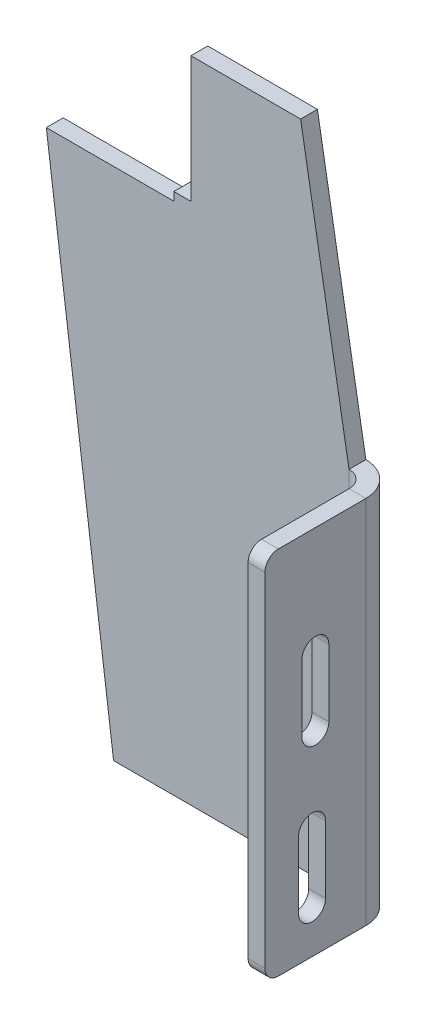
ISO-10303-21;
HEADER;
FILE_DESCRIPTION(('STEP AP214'),'2;1');
FILE_NAME('part.step','',(''),(''),'','','');
FILE_SCHEMA(('AUTOMOTIVE_DESIGN { 1 0 10303 214 1 1 1 1 }'));
ENDSEC;
DATA;
#1=APPLICATION_CONTEXT('core data for automotive mechanical design processes');
#2=APPLICATION_PROTOCOL_DEFINITION('international standard','automotive_design',2000,#1);
#3=PRODUCT_CONTEXT('',#1,'mechanical');
#4=PRODUCT('Part','Part','',(#3));
#5=PRODUCT_RELATED_PRODUCT_CATEGORY('part','',(#4));
#6=PRODUCT_DEFINITION_FORMATION('','',#4);
#7=PRODUCT_DEFINITION_CONTEXT('part definition',#1,'design');
#8=PRODUCT_DEFINITION('design','',#6,#7);
#9=PRODUCT_DEFINITION_SHAPE('','',#8);
#10=(LENGTH_UNIT() NAMED_UNIT(*) SI_UNIT(.MILLI.,.METRE.));
#11=(NAMED_UNIT(*) PLANE_ANGLE_UNIT() SI_UNIT($,.RADIAN.));
#12=(NAMED_UNIT(*) SI_UNIT($,.STERADIAN.) SOLID_ANGLE_UNIT());
#13=UNCERTAINTY_MEASURE_WITH_UNIT(LENGTH_MEASURE(1.E-05),#10,'distance_accuracy_value','');
#14=(GEOMETRIC_REPRESENTATION_CONTEXT(3) GLOBAL_UNCERTAINTY_ASSIGNED_CONTEXT((#13)) GLOBAL_UNIT_ASSIGNED_CONTEXT((#10,
#11,#12)) REPRESENTATION_CONTEXT('',''));
#15=CARTESIAN_POINT('',(0.,0.,0.));
#16=DIRECTION('',(0.,0.,1.));
#17=DIRECTION('',(1.,0.,0.));
#18=AXIS2_PLACEMENT_3D('',#15,#16,#17);
#19=CARTESIAN_POINT('',(-37.6907170617373,-15.3477894324685,-5.));
#20=DIRECTION('',(-1.,0.,0.));
#21=DIRECTION('',(0.,-1.,0.));
#22=AXIS2_PLACEMENT_3D('',#19,#20,#21);
#23=PLANE('',#22);
#24=DIRECTION('',(0.,-1.,0.));
#25=VECTOR('',#24,1.);
#26=CARTESIAN_POINT('',(-37.6907170617373,-15.3477894324685,0.));
#27=LINE('',#26,#25);
#28=CARTESIAN_POINT('',(-37.6907170617373,-12.8477894324692,0.));
#29=VERTEX_POINT('',#28);
#30=CARTESIAN_POINT('',(-37.6907170617373,-15.3477894324685,0.));
#31=VERTEX_POINT('',#30);
#32=EDGE_CURVE('E297',#29,#31,#27,.T.);
#33=ORIENTED_EDGE('',*,*,#32,.F.);
#34=DIRECTION('',(0.,0.,1.));
#35=VECTOR('',#34,1.);
#36=CARTESIAN_POINT('',(-37.6907170617373,-12.8477894324692,-5.));
#37=LINE('',#36,#35);
#38=CARTESIAN_POINT('',(-37.6907170617373,-12.8477894324692,-5.));
#39=VERTEX_POINT('',#38);
#40=EDGE_CURVE('E360',#39,#29,#37,.T.);
#41=ORIENTED_EDGE('',*,*,#40,.F.);
#42=DIRECTION('',(0.,-1.,0.));
#43=VECTOR('',#42,1.);
#44=CARTESIAN_POINT('',(-37.6907170617373,-15.3477894324685,-5.));
#45=LINE('',#44,#43);
#46=CARTESIAN_POINT('',(-37.6907170617373,-15.3477894324685,-5.));
#47=VERTEX_POINT('',#46);
#48=EDGE_CURVE('E306',#39,#47,#45,.T.);
#49=ORIENTED_EDGE('',*,*,#48,.T.);
#50=DIRECTION('',(0.,0.,1.));
#51=VECTOR('',#50,1.);
#52=CARTESIAN_POINT('',(-37.6907170617373,-15.3477894324685,-5.));
#53=LINE('',#52,#51);
#54=EDGE_CURVE('E334',#47,#31,#53,.T.);
#55=ORIENTED_EDGE('',*,*,#54,.T.);
#56=EDGE_LOOP('',(#33,#41,#49,#55));
#57=FACE_BOUND('',#56,.T.);
#58=ADVANCED_FACE('F58',(#57),#23,.T.);
#59=CARTESIAN_POINT('',(-37.6907170617373,-12.8477894324692,-5.));
#60=DIRECTION('',(0.,1.,0.));
#61=DIRECTION('',(-1.,0.,0.));
#62=AXIS2_PLACEMENT_3D('',#59,#60,#61);
#63=PLANE('',#62);
#64=DIRECTION('',(-1.,0.,0.));
#65=VECTOR('',#64,1.);
#66=CARTESIAN_POINT('',(-37.6907170617373,-12.8477894324692,0.));
#67=LINE('',#66,#65);
#68=CARTESIAN_POINT('',(-32.606693765891,-12.8477894324692,0.));
#69=VERTEX_POINT('',#68);
#70=EDGE_CURVE('E310',#69,#29,#67,.T.);
#71=ORIENTED_EDGE('',*,*,#70,.F.);
#72=DIRECTION('',(0.,0.,1.));
#73=VECTOR('',#72,1.);
#74=CARTESIAN_POINT('',(-32.606693765891,-12.8477894324692,-5.));
#75=LINE('',#74,#73);
#76=CARTESIAN_POINT('',(-32.606693765891,-12.8477894324692,-5.));
#77=VERTEX_POINT('',#76);
#78=EDGE_CURVE('E363',#77,#69,#75,.T.);
#79=ORIENTED_EDGE('',*,*,#78,.F.);
#80=DIRECTION('',(-1.,0.,0.));
#81=VECTOR('',#80,1.);
#82=CARTESIAN_POINT('',(-37.6907170617373,-12.8477894324692,-5.));
#83=LINE('',#82,#81);
#84=EDGE_CURVE('E331',#77,#39,#83,.T.);
#85=ORIENTED_EDGE('',*,*,#84,.T.);
#86=ORIENTED_EDGE('',*,*,#40,.T.);
#87=EDGE_LOOP('',(#71,#79,#85,#86));
#88=FACE_BOUND('',#87,.T.);
#89=ADVANCED_FACE('F458',(#88),#63,.T.);
#90=CARTESIAN_POINT('',(-32.606693765891,-12.8477894324692,-5.));
#91=DIRECTION('',(-1.,0.,0.));
#92=DIRECTION('',(0.,0.,1.));
#93=AXIS2_PLACEMENT_3D('',#90,#91,#92);
#94=PLANE('',#93);
#95=DIRECTION('',(0.,-1.,0.));
#96=VECTOR('',#95,1.);
#97=CARTESIAN_POINT('',(-32.606693765891,-12.8477894324692,0.));
#98=LINE('',#97,#96);
#99=CARTESIAN_POINT('',(-32.606693765891,24.6522105675307,0.));
#100=VERTEX_POINT('',#99);
#101=EDGE_CURVE('E355',#100,#69,#98,.T.);
#102=ORIENTED_EDGE('',*,*,#101,.F.);
#103=DIRECTION('',(0.,0.,1.));
#104=VECTOR('',#103,1.);
#105=CARTESIAN_POINT('',(-32.606693765891,24.6522105675307,-5.));
#106=LINE('',#105,#104);
#107=CARTESIAN_POINT('',(-32.606693765891,24.6522105675307,-5.));
#108=VERTEX_POINT('',#107);
#109=EDGE_CURVE('E365',#108,#100,#106,.T.);
#110=ORIENTED_EDGE('',*,*,#109,.F.);
#111=DIRECTION('',(0.,-1.,0.));
#112=VECTOR('',#111,1.);
#113=CARTESIAN_POINT('',(-32.606693765891,-12.8477894324692,-5.));
#114=LINE('',#113,#112);
#115=EDGE_CURVE('E328',#108,#77,#114,.T.);
#116=ORIENTED_EDGE('',*,*,#115,.T.);
#117=ORIENTED_EDGE('',*,*,#78,.T.);
#118=EDGE_LOOP('',(#102,#110,#116,#117));
#119=FACE_BOUND('',#118,.T.);
#120=ADVANCED_FACE('F464',(#119),#94,.T.);
#121=CARTESIAN_POINT('',(-32.606693765891,24.6522105675307,-5.));
#122=DIRECTION('',(0.,1.,0.));
#123=DIRECTION('',(-1.,0.,0.));
#124=AXIS2_PLACEMENT_3D('',#121,#122,#123);
#125=PLANE('',#124);
#126=DIRECTION('',(-1.,0.,0.));
#127=VECTOR('',#126,1.);
#128=CARTESIAN_POINT('',(-32.606693765891,24.6522105675307,0.));
#129=LINE('',#128,#127);
#130=CARTESIAN_POINT('',(0.,24.6522105675307,0.));
#131=VERTEX_POINT('',#130);
#132=EDGE_CURVE('E352',#131,#100,#129,.T.);
#133=ORIENTED_EDGE('',*,*,#132,.F.);
#134=DIRECTION('',(0.,0.,1.));
#135=VECTOR('',#134,1.);
#136=CARTESIAN_POINT('',(0.,24.6522105675307,-5.));
#137=LINE('',#136,#135);
#138=CARTESIAN_POINT('',(0.,24.6522105675307,-5.));
#139=VERTEX_POINT('',#138);
#140=EDGE_CURVE('E367',#139,#131,#137,.T.);
#141=ORIENTED_EDGE('',*,*,#140,.F.);
#142=DIRECTION('',(-1.,0.,0.));
#143=VECTOR('',#142,1.);
#144=CARTESIAN_POINT('',(-32.606693765891,24.6522105675307,-5.));
#145=LINE('',#144,#143);
#146=EDGE_CURVE('E325',#139,#108,#145,.T.);
#147=ORIENTED_EDGE('',*,*,#146,.T.);
#148=ORIENTED_EDGE('',*,*,#109,.T.);
#149=EDGE_LOOP('',(#133,#141,#147,#148));
#150=FACE_BOUND('',#149,.T.);
#151=ADVANCED_FACE('F704',(#150),#125,.T.);
#152=CARTESIAN_POINT('',(14.3933062341091,-58.3477894324685,-5.));
#153=DIRECTION('',(0.985294754055178,0.170863242481657,0.));
#154=DIRECTION('',(-0.170863242481657,0.985294754055178,0.));
#155=AXIS2_PLACEMENT_3D('',#152,#153,#154);
#156=PLANE('',#155);
#157=DIRECTION('',(-0.170863242481657,0.985294754055178,0.));
#158=VECTOR('',#157,1.);
#159=CARTESIAN_POINT('',(14.3933062341091,-58.3477894324685,0.));
#160=LINE('',#159,#158);
#161=CARTESIAN_POINT('',(14.3933062341091,-58.3477894324685,0.));
#162=VERTEX_POINT('',#161);
#163=EDGE_CURVE('E349',#162,#131,#160,.T.);
#164=ORIENTED_EDGE('',*,*,#163,.F.);
#165=DIRECTION('',(0.,0.,1.));
#166=VECTOR('',#165,1.);
#167=CARTESIAN_POINT('',(14.3933062341091,-58.3477894324685,-5.));
#168=LINE('',#167,#166);
#169=CARTESIAN_POINT('',(14.3933062341091,-58.3477894324685,-5.));
#170=VERTEX_POINT('',#169);
#171=EDGE_CURVE('E369',#170,#162,#168,.T.);
#172=ORIENTED_EDGE('',*,*,#171,.F.);
#173=DIRECTION('',(-0.170863242481657,0.985294754055178,0.));
#174=VECTOR('',#173,1.);
#175=CARTESIAN_POINT('',(14.3933062341091,-58.3477894324685,-5.));
#176=LINE('',#175,#174);
#177=EDGE_CURVE('E322',#170,#139,#176,.T.);
#178=ORIENTED_EDGE('',*,*,#177,.T.);
#179=ORIENTED_EDGE('',*,*,#140,.T.);
#180=EDGE_LOOP('',(#164,#172,#178,#179));
#181=FACE_BOUND('',#180,.T.);
#182=ADVANCED_FACE('F695',(#181),#156,.T.);
#183=CARTESIAN_POINT('',(-55.6066937658909,-168.347789432469,-5.));
#184=DIRECTION('',(0.,-1.,0.));
#185=DIRECTION('',(0.,0.,-1.));
#186=AXIS2_PLACEMENT_3D('',#183,#184,#185);
#187=PLANE('',#186);
#188=DIRECTION('',(1.,0.,0.));
#189=VECTOR('',#188,1.);
#190=CARTESIAN_POINT('',(-55.6066937658909,-168.347789432469,0.));
#191=LINE('',#190,#189);
#192=CARTESIAN_POINT('',(-55.6066937658909,-168.347789432469,0.));
#193=VERTEX_POINT('',#192);
#194=CARTESIAN_POINT('',(14.3933062341091,-168.347789432469,0.));
#195=VERTEX_POINT('',#194);
#196=EDGE_CURVE('E343',#193,#195,#191,.T.);
#197=ORIENTED_EDGE('',*,*,#196,.F.);
#198=DIRECTION('',(0.,0.,1.));
#199=VECTOR('',#198,1.);
#200=CARTESIAN_POINT('',(-55.6066937658909,-168.347789432469,-5.));
#201=LINE('',#200,#199);
#202=CARTESIAN_POINT('',(-55.6066937658909,-168.347789432469,-5.));
#203=VERTEX_POINT('',#202);
#204=EDGE_CURVE('E374',#203,#193,#201,.T.);
#205=ORIENTED_EDGE('',*,*,#204,.F.);
#206=DIRECTION('',(1.,0.,0.));
#207=VECTOR('',#206,1.);
#208=CARTESIAN_POINT('',(-55.6066937658909,-168.347789432469,-5.));
#209=LINE('',#208,#207);
#210=CARTESIAN_POINT('',(14.3933062341091,-168.347789432469,-5.));
#211=VERTEX_POINT('',#210);
#212=EDGE_CURVE('E316',#203,#211,#209,.T.);
#213=ORIENTED_EDGE('',*,*,#212,.T.);
#214=DIRECTION('',(0.,0.,1.));
#215=VECTOR('',#214,1.);
#216=CARTESIAN_POINT('',(14.3933062341091,-168.347789432469,-5.));
#217=LINE('',#216,#215);
#218=EDGE_CURVE('E372',#211,#195,#217,.T.);
#219=ORIENTED_EDGE('',*,*,#218,.T.);
#220=EDGE_LOOP('',(#197,#205,#213,#219));
#221=FACE_BOUND('',#220,.T.);
#222=ADVANCED_FACE('F440',(#221),#187,.T.);
#223=CARTESIAN_POINT('',(-55.6066937658909,-168.347789432469,-5.));
#224=DIRECTION('',(-0.991564234122968,-0.129616239754637,0.));
#225=DIRECTION('',(0.129616239754637,-0.991564234122968,0.));
#226=AXIS2_PLACEMENT_3D('',#223,#224,#225);
#227=PLANE('',#226);
#228=DIRECTION('',(0.129616239754637,-0.991564234122968,0.));
#229=VECTOR('',#228,1.);
#230=CARTESIAN_POINT('',(-55.6066937658909,-168.347789432469,0.));
#231=LINE('',#230,#229);
#232=CARTESIAN_POINT('',(-75.6066937658909,-15.3477894324685,0.));
#233=VERTEX_POINT('',#232);
#234=EDGE_CURVE('E340',#233,#193,#231,.T.);
#235=ORIENTED_EDGE('',*,*,#234,.F.);
#236=DIRECTION('',(0.,0.,1.));
#237=VECTOR('',#236,1.);
#238=CARTESIAN_POINT('',(-75.6066937658909,-15.3477894324685,-5.));
#239=LINE('',#238,#237);
#240=CARTESIAN_POINT('',(-75.6066937658909,-15.3477894324685,-5.));
#241=VERTEX_POINT('',#240);
#242=EDGE_CURVE('E376',#241,#233,#239,.T.);
#243=ORIENTED_EDGE('',*,*,#242,.F.);
#244=DIRECTION('',(0.129616239754637,-0.991564234122968,0.));
#245=VECTOR('',#244,1.);
#246=CARTESIAN_POINT('',(-55.6066937658909,-168.347789432469,-5.));
#247=LINE('',#246,#245);
#248=EDGE_CURVE('E313',#241,#203,#247,.T.);
#249=ORIENTED_EDGE('',*,*,#248,.T.);
#250=ORIENTED_EDGE('',*,*,#204,.T.);
#251=EDGE_LOOP('',(#235,#243,#249,#250));
#252=FACE_BOUND('',#251,.T.);
#253=ADVANCED_FACE('F675',(#252),#227,.T.);
#254=CARTESIAN_POINT('',(-75.6066937658909,-15.3477894324685,-5.));
#255=DIRECTION('',(0.,1.,0.));
#256=DIRECTION('',(-1.,0.,0.));
#257=AXIS2_PLACEMENT_3D('',#254,#255,#256);
#258=PLANE('',#257);
#259=DIRECTION('',(-1.,0.,0.));
#260=VECTOR('',#259,1.);
#261=CARTESIAN_POINT('',(-75.6066937658909,-15.3477894324685,0.));
#262=LINE('',#261,#260);
#263=EDGE_CURVE('E337',#31,#233,#262,.T.);
#264=ORIENTED_EDGE('',*,*,#263,.F.);
#265=ORIENTED_EDGE('',*,*,#54,.F.);
#266=DIRECTION('',(-1.,0.,0.));
#267=VECTOR('',#266,1.);
#268=CARTESIAN_POINT('',(-75.6066937658909,-15.3477894324685,-5.));
#269=LINE('',#268,#267);
#270=EDGE_CURVE('E309',#47,#241,#269,.T.);
#271=ORIENTED_EDGE('',*,*,#270,.T.);
#272=ORIENTED_EDGE('',*,*,#242,.T.);
#273=EDGE_LOOP('',(#264,#265,#271,#272));
#274=FACE_BOUND('',#273,.T.);
#275=ADVANCED_FACE('F469',(#274),#258,.T.);
#276=CARTESIAN_POINT('',(0.,0.,-5.));
#277=DIRECTION('',(0.,0.,-1.));
#278=DIRECTION('',(-1.,0.,0.));
#279=AXIS2_PLACEMENT_3D('',#276,#277,#278);
#280=PLANE('',#279);
#281=ORIENTED_EDGE('',*,*,#48,.F.);
#282=ORIENTED_EDGE('',*,*,#84,.F.);
#283=ORIENTED_EDGE('',*,*,#115,.F.);
#284=ORIENTED_EDGE('',*,*,#146,.F.);
#285=ORIENTED_EDGE('',*,*,#177,.F.);
#286=DIRECTION('',(0.,1.,0.));
#287=VECTOR('',#286,1.);
#288=CARTESIAN_POINT('',(14.3933062341091,-168.347789432469,-5.));
#289=LINE('',#288,#287);
#290=EDGE_CURVE('E319',#211,#170,#289,.T.);
#291=ORIENTED_EDGE('',*,*,#290,.F.);
#292=ORIENTED_EDGE('',*,*,#212,.F.);
#293=ORIENTED_EDGE('',*,*,#248,.F.);
#294=ORIENTED_EDGE('',*,*,#270,.F.);
#295=EDGE_LOOP('',(#281,#282,#283,#284,#285,#291,#292,#293,#294));
#296=FACE_BOUND('',#295,.T.);
#297=ADVANCED_FACE('F654',(#296),#280,.T.);
#298=CARTESIAN_POINT('',(0.,0.,0.));
#299=DIRECTION('',(0.,0.,-1.));
#300=DIRECTION('',(-1.,0.,0.));
#301=AXIS2_PLACEMENT_3D('',#298,#299,#300);
#302=PLANE('',#301);
#303=ORIENTED_EDGE('',*,*,#32,.T.);
#304=ORIENTED_EDGE('',*,*,#263,.T.);
#305=ORIENTED_EDGE('',*,*,#234,.T.);
#306=ORIENTED_EDGE('',*,*,#196,.T.);
#307=DIRECTION('',(0.,1.,0.));
#308=VECTOR('',#307,1.);
#309=CARTESIAN_POINT('',(14.3933062341091,-168.347789432469,0.));
#310=LINE('',#309,#308);
#311=EDGE_CURVE('E346',#195,#162,#310,.T.);
#312=ORIENTED_EDGE('',*,*,#311,.T.);
#313=ORIENTED_EDGE('',*,*,#163,.T.);
#314=ORIENTED_EDGE('',*,*,#132,.T.);
#315=ORIENTED_EDGE('',*,*,#101,.T.);
#316=ORIENTED_EDGE('',*,*,#70,.T.);
#317=EDGE_LOOP('',(#303,#304,#305,#306,#312,#313,#314,#315,#316));
#318=FACE_BOUND('',#317,.T.);
#319=ADVANCED_FACE('F444',(#318),#302,.F.);
#320=CARTESIAN_POINT('',(14.3933062341091,-168.347789432469,5.));
#321=DIRECTION('',(0.,-1.,0.));
#322=DIRECTION('',(0.,0.,-1.));
#323=AXIS2_PLACEMENT_3D('',#320,#321,#322);
#324=PLANE('',#323);
#325=DIRECTION('',(-1.,0.,0.));
#326=VECTOR('',#325,1.);
#327=CARTESIAN_POINT('',(24.3933062341091,-168.347789432469,4.99999999999997));
#328=LINE('',#327,#326);
#329=CARTESIAN_POINT('',(19.3933062341091,-168.347789432469,4.99999999999999));
#330=VERTEX_POINT('',#329);
#331=CARTESIAN_POINT('',(24.3933062341091,-168.347789432469,4.99999999999997));
#332=VERTEX_POINT('',#331);
#333=EDGE_CURVE('E248',#330,#332,#328,.F.);
#334=ORIENTED_EDGE('',*,*,#333,.F.);
#335=CARTESIAN_POINT('',(14.3933062341091,-168.347789432469,5.));
#336=DIRECTION('',(0.,1.,0.));
#337=DIRECTION('',(0.,0.,1.));
#338=AXIS2_PLACEMENT_3D('',#335,#336,#337);
#339=CIRCLE('',#338,5.);
#340=EDGE_CURVE('E301',#195,#330,#339,.F.);
#341=ORIENTED_EDGE('',*,*,#340,.F.);
#342=ORIENTED_EDGE('',*,*,#218,.F.);
#343=CARTESIAN_POINT('',(14.3933062341091,-168.347789432469,5.));
#344=DIRECTION('',(0.,1.,0.));
#345=DIRECTION('',(0.,0.,1.));
#346=AXIS2_PLACEMENT_3D('',#343,#344,#345);
#347=CIRCLE('',#346,10.);
#348=EDGE_CURVE('E294',#211,#332,#347,.F.);
#349=ORIENTED_EDGE('',*,*,#348,.T.);
#350=EDGE_LOOP('',(#334,#341,#342,#349));
#351=FACE_BOUND('',#350,.T.);
#352=ADVANCED_FACE('F436',(#351),#324,.T.);
#353=CARTESIAN_POINT('',(14.3933062341091,-58.3477894324685,5.));
#354=DIRECTION('',(0.,-1.,0.));
#355=DIRECTION('',(0.,0.,-1.));
#356=AXIS2_PLACEMENT_3D('',#353,#354,#355);
#357=PLANE('',#356);
#358=CARTESIAN_POINT('',(14.3933062341091,-58.3477894324685,5.));
#359=DIRECTION('',(0.,1.,0.));
#360=DIRECTION('',(0.,0.,1.));
#361=AXIS2_PLACEMENT_3D('',#358,#359,#360);
#362=CIRCLE('',#361,5.);
#363=CARTESIAN_POINT('',(19.3933062341091,-58.3477894324685,4.99999999999999));
#364=VERTEX_POINT('',#363);
#365=EDGE_CURVE('E273',#364,#162,#362,.T.);
#366=ORIENTED_EDGE('',*,*,#365,.F.);
#367=DIRECTION('',(-1.,0.,0.));
#368=VECTOR('',#367,1.);
#369=CARTESIAN_POINT('',(19.3933062341091,-58.3477894324685,4.99999999999999));
#370=LINE('',#369,#368);
#371=CARTESIAN_POINT('',(24.3933062341091,-58.3477894324685,4.99999999999997));
#372=VERTEX_POINT('',#371);
#373=EDGE_CURVE('E287',#364,#372,#370,.F.);
#374=ORIENTED_EDGE('',*,*,#373,.T.);
#375=CARTESIAN_POINT('',(14.3933062341091,-58.3477894324685,5.));
#376=DIRECTION('',(0.,1.,0.));
#377=DIRECTION('',(0.,0.,1.));
#378=AXIS2_PLACEMENT_3D('',#375,#376,#377);
#379=CIRCLE('',#378,10.);
#380=EDGE_CURVE('E298',#372,#170,#379,.T.);
#381=ORIENTED_EDGE('',*,*,#380,.T.);
#382=ORIENTED_EDGE('',*,*,#171,.T.);
#383=EDGE_LOOP('',(#366,#374,#381,#382));
#384=FACE_BOUND('',#383,.T.);
#385=ADVANCED_FACE('F430',(#384),#357,.F.);
#386=CARTESIAN_POINT('',(14.3933062341091,-58.3477894324685,5.));
#387=DIRECTION('',(0.,1.,0.));
#388=DIRECTION('',(1.,0.,0.));
#389=AXIS2_PLACEMENT_3D('',#386,#387,#388);
#390=CYLINDRICAL_SURFACE('',#389,10.);
#391=ORIENTED_EDGE('',*,*,#290,.T.);
#392=ORIENTED_EDGE('',*,*,#380,.F.);
#393=DIRECTION('',(0.,1.,0.));
#394=VECTOR('',#393,1.);
#395=CARTESIAN_POINT('',(24.3933062341091,-168.347789432469,4.99999999999997));
#396=LINE('',#395,#394);
#397=EDGE_CURVE('E284',#372,#332,#396,.F.);
#398=ORIENTED_EDGE('',*,*,#397,.T.);
#399=ORIENTED_EDGE('',*,*,#348,.F.);
#400=EDGE_LOOP('',(#391,#392,#398,#399));
#401=FACE_BOUND('',#400,.T.);
#402=ADVANCED_FACE('F433',(#401),#390,.T.);
#403=CARTESIAN_POINT('',(14.3933062341091,-58.3477894324685,5.));
#404=DIRECTION('',(0.,1.,0.));
#405=DIRECTION('',(1.,0.,0.));
#406=AXIS2_PLACEMENT_3D('',#403,#404,#405);
#407=CYLINDRICAL_SURFACE('',#406,5.);
#408=ORIENTED_EDGE('',*,*,#311,.F.);
#409=ORIENTED_EDGE('',*,*,#340,.T.);
#410=DIRECTION('',(0.,1.,0.));
#411=VECTOR('',#410,1.);
#412=CARTESIAN_POINT('',(19.3933062341091,-168.347789432469,4.99999999999998));
#413=LINE('',#412,#411);
#414=EDGE_CURVE('E290',#330,#364,#413,.T.);
#415=ORIENTED_EDGE('',*,*,#414,.T.);
#416=ORIENTED_EDGE('',*,*,#365,.T.);
#417=EDGE_LOOP('',(#408,#409,#415,#416));
#418=FACE_BOUND('',#417,.T.);
#419=ADVANCED_FACE('F447',(#418),#407,.F.);
#420=CARTESIAN_POINT('',(24.3933062341091,-168.347789432469,0.));
#421=DIRECTION('',(0.,1.,0.));
#422=DIRECTION('',(0.,0.,1.));
#423=AXIS2_PLACEMENT_3D('',#420,#421,#422);
#424=PLANE('',#423);
#425=DIRECTION('',(0.,0.,-1.));
#426=VECTOR('',#425,1.);
#427=CARTESIAN_POINT('',(24.3933062341091,-168.347789432469,0.));
#428=LINE('',#427,#426);
#429=CARTESIAN_POINT('',(24.3933062341092,-168.347789432469,31.));
#430=VERTEX_POINT('',#429);
#431=EDGE_CURVE('E276',#430,#332,#428,.T.);
#432=ORIENTED_EDGE('',*,*,#431,.F.);
#433=DIRECTION('',(-1.,0.,0.));
#434=VECTOR('',#433,1.);
#435=CARTESIAN_POINT('',(24.3933062341092,-168.347789432469,31.));
#436=LINE('',#435,#434);
#437=CARTESIAN_POINT('',(19.3933062341092,-168.347789432469,31.));
#438=VERTEX_POINT('',#437);
#439=EDGE_CURVE('E394',#430,#438,#436,.T.);
#440=ORIENTED_EDGE('',*,*,#439,.T.);
#441=DIRECTION('',(0.,0.,1.));
#442=VECTOR('',#441,1.);
#443=CARTESIAN_POINT('',(19.3933062341091,-168.347789432469,0.));
#444=LINE('',#443,#442);
#445=EDGE_CURVE('E282',#438,#330,#444,.F.);
#446=ORIENTED_EDGE('',*,*,#445,.T.);
#447=ORIENTED_EDGE('',*,*,#333,.T.);
#448=EDGE_LOOP('',(#432,#440,#446,#447));
#449=FACE_BOUND('',#448,.T.);
#450=ADVANCED_FACE('F413',(#449),#424,.F.);
#451=CARTESIAN_POINT('',(24.3933062341092,-58.3477894324685,35.));
#452=DIRECTION('',(0.,-1.,0.));
#453=DIRECTION('',(0.,0.,-1.));
#454=AXIS2_PLACEMENT_3D('',#451,#452,#453);
#455=PLANE('',#454);
#456=DIRECTION('',(0.,0.,-1.));
#457=VECTOR('',#456,1.);
#458=CARTESIAN_POINT('',(19.3933062341092,-58.3477894324685,35.));
#459=LINE('',#458,#457);
#460=CARTESIAN_POINT('',(19.3933062341092,-58.3477894324685,31.));
#461=VERTEX_POINT('',#460);
#462=EDGE_CURVE('E280',#364,#461,#459,.F.);
#463=ORIENTED_EDGE('',*,*,#462,.T.);
#464=DIRECTION('',(-1.,0.,0.));
#465=VECTOR('',#464,1.);
#466=CARTESIAN_POINT('',(24.3933062341092,-58.3477894324685,31.));
#467=LINE('',#466,#465);
#468=CARTESIAN_POINT('',(24.3933062341092,-58.3477894324685,31.));
#469=VERTEX_POINT('',#468);
#470=EDGE_CURVE('E13',#461,#469,#467,.F.);
#471=ORIENTED_EDGE('',*,*,#470,.T.);
#472=DIRECTION('',(0.,0.,1.));
#473=VECTOR('',#472,1.);
#474=CARTESIAN_POINT('',(24.3933062341091,-58.3477894324685,0.));
#475=LINE('',#474,#473);
#476=EDGE_CURVE('E274',#372,#469,#475,.T.);
#477=ORIENTED_EDGE('',*,*,#476,.F.);
#478=ORIENTED_EDGE('',*,*,#373,.F.);
#479=EDGE_LOOP('',(#463,#471,#477,#478));
#480=FACE_BOUND('',#479,.T.);
#481=ADVANCED_FACE('F427',(#480),#455,.F.);
#482=CARTESIAN_POINT('',(24.3933062341091,0.,0.));
#483=DIRECTION('',(-1.,0.,0.));
#484=DIRECTION('',(0.,0.,1.));
#485=AXIS2_PLACEMENT_3D('',#482,#483,#484);
#486=PLANE('',#485);
#487=DIRECTION('',(0.,1.,0.));
#488=VECTOR('',#487,1.);
#489=CARTESIAN_POINT('',(24.3933062341091,-110.347789432469,16.0000000000001));
#490=LINE('',#489,#488);
#491=CARTESIAN_POINT('',(24.3933062341091,-110.347789432469,16.0000000000001));
#492=VERTEX_POINT('',#491);
#493=CARTESIAN_POINT('',(24.3933062341091,-90.3477894324685,16.0000000000001));
#494=VERTEX_POINT('',#493);
#495=EDGE_CURVE('E231',#492,#494,#490,.T.);
#496=ORIENTED_EDGE('',*,*,#495,.F.);
#497=CARTESIAN_POINT('',(24.3933062341092,-110.347789432469,20.0000000000001));
#498=DIRECTION('',(1.,0.,0.));
#499=DIRECTION('',(0.,0.,-1.));
#500=AXIS2_PLACEMENT_3D('',#497,#498,#499);
#501=CIRCLE('',#500,4.);
#502=CARTESIAN_POINT('',(24.3933062341092,-110.347789432469,24.0000000000001));
#503=VERTEX_POINT('',#502);
#504=EDGE_CURVE('E236',#503,#492,#501,.T.);
#505=ORIENTED_EDGE('',*,*,#504,.F.);
#506=DIRECTION('',(0.,-1.,0.));
#507=VECTOR('',#506,1.);
#508=CARTESIAN_POINT('',(24.3933062341092,-110.347789432469,24.0000000000001));
#509=LINE('',#508,#507);
#510=CARTESIAN_POINT('',(24.3933062341092,-90.3477894324686,24.0000000000001));
#511=VERTEX_POINT('',#510);
#512=EDGE_CURVE('E241',#511,#503,#509,.T.);
#513=ORIENTED_EDGE('',*,*,#512,.F.);
#514=CARTESIAN_POINT('',(24.3933062341092,-90.3477894324685,20.0000000000001));
#515=DIRECTION('',(1.,0.,0.));
#516=DIRECTION('',(0.,0.,-1.));
#517=AXIS2_PLACEMENT_3D('',#514,#515,#516);
#518=CIRCLE('',#517,4.);
#519=EDGE_CURVE('E220',#494,#511,#518,.T.);
#520=ORIENTED_EDGE('',*,*,#519,.F.);
#521=EDGE_LOOP('',(#496,#505,#513,#520));
#522=FACE_BOUND('',#521,.T.);
#523=DIRECTION('',(0.,1.,0.));
#524=VECTOR('',#523,1.);
#525=CARTESIAN_POINT('',(24.3933062341091,-155.336682434891,16.9997531778317));
#526=LINE('',#525,#524);
#527=CARTESIAN_POINT('',(24.3933062341091,-155.336682434891,16.9997531778317));
#528=VERTEX_POINT('',#527);
#529=CARTESIAN_POINT('',(24.3933062341091,-135.336682434891,16.9997531778317));
#530=VERTEX_POINT('',#529);
#531=EDGE_CURVE('E253',#528,#530,#526,.T.);
#532=ORIENTED_EDGE('',*,*,#531,.F.);
#533=CARTESIAN_POINT('',(24.3933062341092,-155.336682434891,20.9997531778317));
#534=DIRECTION('',(1.,0.,0.));
#535=DIRECTION('',(0.,0.,-1.));
#536=AXIS2_PLACEMENT_3D('',#533,#534,#535);
#537=CIRCLE('',#536,4.00000000000001);
#538=CARTESIAN_POINT('',(24.3933062341092,-155.336682434891,24.9997531778317));
#539=VERTEX_POINT('',#538);
#540=EDGE_CURVE('E251',#539,#528,#537,.T.);
#541=ORIENTED_EDGE('',*,*,#540,.F.);
#542=DIRECTION('',(0.,-1.,0.));
#543=VECTOR('',#542,1.);
#544=CARTESIAN_POINT('',(24.3933062341092,-155.336682434891,24.9997531778317));
#545=LINE('',#544,#543);
#546=CARTESIAN_POINT('',(24.3933062341092,-135.336682434891,24.9997531778317));
#547=VERTEX_POINT('',#546);
#548=EDGE_CURVE('E259',#547,#539,#545,.T.);
#549=ORIENTED_EDGE('',*,*,#548,.F.);
#550=CARTESIAN_POINT('',(24.3933062341092,-135.336682434891,20.9997531778317));
#551=DIRECTION('',(1.,0.,0.));
#552=DIRECTION('',(0.,0.,-1.));
#553=AXIS2_PLACEMENT_3D('',#550,#551,#552);
#554=CIRCLE('',#553,4.00000000000001);
#555=EDGE_CURVE('E256',#530,#547,#554,.T.);
#556=ORIENTED_EDGE('',*,*,#555,.F.);
#557=EDGE_LOOP('',(#532,#541,#549,#556));
#558=FACE_BOUND('',#557,.T.);
#559=DIRECTION('',(0.,-1.,0.));
#560=VECTOR('',#559,1.);
#561=CARTESIAN_POINT('',(24.3933062341092,0.,35.));
#562=LINE('',#561,#560);
#563=CARTESIAN_POINT('',(24.3933062341092,-62.3477894324685,35.));
#564=VERTEX_POINT('',#563);
#565=CARTESIAN_POINT('',(24.3933062341092,-164.347789432469,35.));
#566=VERTEX_POINT('',#565);
#567=EDGE_CURVE('E271',#564,#566,#562,.T.);
#568=ORIENTED_EDGE('',*,*,#567,.T.);
#569=CARTESIAN_POINT('',(24.3933062341092,-164.347789432469,31.));
#570=DIRECTION('',(-1.,0.,0.));
#571=DIRECTION('',(0.,0.,1.));
#572=AXIS2_PLACEMENT_3D('',#569,#570,#571);
#573=CIRCLE('',#572,4.);
#574=EDGE_CURVE('E66',#566,#430,#573,.F.);
#575=ORIENTED_EDGE('',*,*,#574,.T.);
#576=ORIENTED_EDGE('',*,*,#431,.T.);
#577=ORIENTED_EDGE('',*,*,#397,.F.);
#578=ORIENTED_EDGE('',*,*,#476,.T.);
#579=CARTESIAN_POINT('',(24.3933062341092,-62.3477894324685,31.));
#580=DIRECTION('',(-1.,0.,0.));
#581=DIRECTION('',(0.,0.,1.));
#582=AXIS2_PLACEMENT_3D('',#579,#580,#581);
#583=CIRCLE('',#582,4.);
#584=EDGE_CURVE('E405',#469,#564,#583,.F.);
#585=ORIENTED_EDGE('',*,*,#584,.T.);
#586=EDGE_LOOP('',(#568,#575,#576,#577,#578,#585));
#587=FACE_BOUND('',#586,.T.);
#588=ADVANCED_FACE('F238',(#522,#558,#587),#486,.F.);
#589=CARTESIAN_POINT('',(19.3933062341091,0.,0.));
#590=DIRECTION('',(-1.,0.,0.));
#591=DIRECTION('',(0.,0.,1.));
#592=AXIS2_PLACEMENT_3D('',#589,#590,#591);
#593=PLANE('',#592);
#594=CARTESIAN_POINT('',(19.3933062341092,-110.347789432469,20.0000000000001));
#595=DIRECTION('',(-1.,0.,0.));
#596=DIRECTION('',(0.,0.,1.));
#597=AXIS2_PLACEMENT_3D('',#594,#595,#596);
#598=CIRCLE('',#597,4.);
#599=CARTESIAN_POINT('',(19.3933062341091,-110.347789432469,16.0000000000001));
#600=VERTEX_POINT('',#599);
#601=CARTESIAN_POINT('',(19.3933062341092,-110.347789432469,24.0000000000001));
#602=VERTEX_POINT('',#601);
#603=EDGE_CURVE('E392',#600,#602,#598,.T.);
#604=ORIENTED_EDGE('',*,*,#603,.F.);
#605=DIRECTION('',(0.,-1.,0.));
#606=VECTOR('',#605,1.);
#607=CARTESIAN_POINT('',(19.3933062341091,0.,16.0000000000001));
#608=LINE('',#607,#606);
#609=CARTESIAN_POINT('',(19.3933062341091,-90.3477894324685,16.0000000000001));
#610=VERTEX_POINT('',#609);
#611=EDGE_CURVE('E387',#610,#600,#608,.T.);
#612=ORIENTED_EDGE('',*,*,#611,.F.);
#613=CARTESIAN_POINT('',(19.3933062341092,-90.3477894324685,20.0000000000001));
#614=DIRECTION('',(-1.,0.,0.));
#615=DIRECTION('',(0.,0.,1.));
#616=AXIS2_PLACEMENT_3D('',#613,#614,#615);
#617=CIRCLE('',#616,4.);
#618=CARTESIAN_POINT('',(19.3933062341092,-90.3477894324686,24.0000000000001));
#619=VERTEX_POINT('',#618);
#620=EDGE_CURVE('E223',#619,#610,#617,.T.);
#621=ORIENTED_EDGE('',*,*,#620,.F.);
#622=DIRECTION('',(0.,1.,0.));
#623=VECTOR('',#622,1.);
#624=CARTESIAN_POINT('',(19.3933062341092,0.,24.0000000000001));
#625=LINE('',#624,#623);
#626=EDGE_CURVE('E390',#602,#619,#625,.T.);
#627=ORIENTED_EDGE('',*,*,#626,.F.);
#628=EDGE_LOOP('',(#604,#612,#621,#627));
#629=FACE_BOUND('',#628,.T.);
#630=CARTESIAN_POINT('',(19.3933062341092,-155.336682434891,20.9997531778317));
#631=DIRECTION('',(-1.,0.,0.));
#632=DIRECTION('',(0.,0.,1.));
#633=AXIS2_PLACEMENT_3D('',#630,#631,#632);
#634=CIRCLE('',#633,4.00000000000001);
#635=CARTESIAN_POINT('',(19.3933062341091,-155.336682434891,16.9997531778317));
#636=VERTEX_POINT('',#635);
#637=CARTESIAN_POINT('',(19.3933062341092,-155.336682434891,24.9997531778317));
#638=VERTEX_POINT('',#637);
#639=EDGE_CURVE('E385',#636,#638,#634,.T.);
#640=ORIENTED_EDGE('',*,*,#639,.F.);
#641=DIRECTION('',(0.,-1.,0.));
#642=VECTOR('',#641,1.);
#643=CARTESIAN_POINT('',(19.3933062341091,0.,16.9997531778317));
#644=LINE('',#643,#642);
#645=CARTESIAN_POINT('',(19.3933062341091,-135.336682434891,16.9997531778317));
#646=VERTEX_POINT('',#645);
#647=EDGE_CURVE('E362',#646,#636,#644,.T.);
#648=ORIENTED_EDGE('',*,*,#647,.F.);
#649=CARTESIAN_POINT('',(19.3933062341092,-135.336682434891,20.9997531778317));
#650=DIRECTION('',(-1.,0.,0.));
#651=DIRECTION('',(0.,0.,1.));
#652=AXIS2_PLACEMENT_3D('',#649,#650,#651);
#653=CIRCLE('',#652,4.00000000000001);
#654=CARTESIAN_POINT('',(19.3933062341092,-135.336682434891,24.9997531778317));
#655=VERTEX_POINT('',#654);
#656=EDGE_CURVE('E380',#655,#646,#653,.T.);
#657=ORIENTED_EDGE('',*,*,#656,.F.);
#658=DIRECTION('',(0.,1.,0.));
#659=VECTOR('',#658,1.);
#660=CARTESIAN_POINT('',(19.3933062341092,0.,24.9997531778318));
#661=LINE('',#660,#659);
#662=EDGE_CURVE('E383',#638,#655,#661,.T.);
#663=ORIENTED_EDGE('',*,*,#662,.F.);
#664=EDGE_LOOP('',(#640,#648,#657,#663));
#665=FACE_BOUND('',#664,.T.);
#666=ORIENTED_EDGE('',*,*,#445,.F.);
#667=CARTESIAN_POINT('',(19.3933062341092,-164.347789432469,31.));
#668=DIRECTION('',(-1.,0.,0.));
#669=DIRECTION('',(0.,0.,1.));
#670=AXIS2_PLACEMENT_3D('',#667,#668,#669);
#671=CIRCLE('',#670,4.);
#672=CARTESIAN_POINT('',(19.3933062341092,-164.347789432469,35.));
#673=VERTEX_POINT('',#672);
#674=EDGE_CURVE('E399',#438,#673,#671,.T.);
#675=ORIENTED_EDGE('',*,*,#674,.T.);
#676=DIRECTION('',(0.,1.,0.));
#677=VECTOR('',#676,1.);
#678=CARTESIAN_POINT('',(19.3933062341092,-168.347789432469,35.));
#679=LINE('',#678,#677);
#680=CARTESIAN_POINT('',(19.3933062341092,-62.3477894324685,35.));
#681=VERTEX_POINT('',#680);
#682=EDGE_CURVE('E278',#681,#673,#679,.F.);
#683=ORIENTED_EDGE('',*,*,#682,.F.);
#684=CARTESIAN_POINT('',(19.3933062341092,-62.3477894324685,31.));
#685=DIRECTION('',(-1.,0.,0.));
#686=DIRECTION('',(0.,0.,1.));
#687=AXIS2_PLACEMENT_3D('',#684,#685,#686);
#688=CIRCLE('',#687,4.);
#689=EDGE_CURVE('E397',#681,#461,#688,.T.);
#690=ORIENTED_EDGE('',*,*,#689,.T.);
#691=ORIENTED_EDGE('',*,*,#462,.F.);
#692=ORIENTED_EDGE('',*,*,#414,.F.);
#693=EDGE_LOOP('',(#666,#675,#683,#690,#691,#692));
#694=FACE_BOUND('',#693,.T.);
#695=ADVANCED_FACE('F419',(#629,#665,#694),#593,.T.);
#696=CARTESIAN_POINT('',(24.3933062341092,-168.347789432469,35.));
#697=DIRECTION('',(0.,0.,-1.));
#698=DIRECTION('',(-1.,0.,0.));
#699=AXIS2_PLACEMENT_3D('',#696,#697,#698);
#700=PLANE('',#699);
#701=ORIENTED_EDGE('',*,*,#682,.T.);
#702=DIRECTION('',(-1.,0.,0.));
#703=VECTOR('',#702,1.);
#704=CARTESIAN_POINT('',(24.3933062341092,-164.347789432469,35.));
#705=LINE('',#704,#703);
#706=EDGE_CURVE('E79',#673,#566,#705,.F.);
#707=ORIENTED_EDGE('',*,*,#706,.T.);
#708=ORIENTED_EDGE('',*,*,#567,.F.);
#709=DIRECTION('',(-1.,0.,0.));
#710=VECTOR('',#709,1.);
#711=CARTESIAN_POINT('',(24.3933062341092,-62.3477894324685,35.));
#712=LINE('',#711,#710);
#713=EDGE_CURVE('E401',#564,#681,#712,.T.);
#714=ORIENTED_EDGE('',*,*,#713,.T.);
#715=EDGE_LOOP('',(#701,#707,#708,#714));
#716=FACE_BOUND('',#715,.T.);
#717=ADVANCED_FACE('F421',(#716),#700,.F.);
#718=CARTESIAN_POINT('',(-75.606693765891,-155.336682434891,20.999753177832));
#719=DIRECTION('',(1.,0.,0.));
#720=DIRECTION('',(0.,0.,-1.));
#721=AXIS2_PLACEMENT_3D('',#718,#719,#720);
#722=CYLINDRICAL_SURFACE('',#721,4.00000000000001);
#723=ORIENTED_EDGE('',*,*,#639,.T.);
#724=DIRECTION('',(1.,0.,0.));
#725=VECTOR('',#724,1.);
#726=CARTESIAN_POINT('',(-75.606693765891,-155.336682434891,24.999753177832));
#727=LINE('',#726,#725);
#728=EDGE_CURVE('E263',#638,#539,#727,.T.);
#729=ORIENTED_EDGE('',*,*,#728,.T.);
#730=ORIENTED_EDGE('',*,*,#540,.T.);
#731=DIRECTION('',(1.,0.,0.));
#732=VECTOR('',#731,1.);
#733=CARTESIAN_POINT('',(-75.606693765891,-155.336682434891,16.999753177832));
#734=LINE('',#733,#732);
#735=EDGE_CURVE('E262',#636,#528,#734,.T.);
#736=ORIENTED_EDGE('',*,*,#735,.F.);
#737=EDGE_LOOP('',(#723,#729,#730,#736));
#738=FACE_BOUND('',#737,.T.);
#739=ADVANCED_FACE('F493',(#738),#722,.F.);
#740=CARTESIAN_POINT('',(-75.606693765891,-155.336682434891,24.999753177832));
#741=DIRECTION('',(0.,0.,1.));
#742=DIRECTION('',(1.,0.,0.));
#743=AXIS2_PLACEMENT_3D('',#740,#741,#742);
#744=PLANE('',#743);
#745=ORIENTED_EDGE('',*,*,#662,.T.);
#746=DIRECTION('',(1.,0.,0.));
#747=VECTOR('',#746,1.);
#748=CARTESIAN_POINT('',(-75.606693765891,-135.336682434891,24.9997531778321));
#749=LINE('',#748,#747);
#750=EDGE_CURVE('E265',#655,#547,#749,.T.);
#751=ORIENTED_EDGE('',*,*,#750,.T.);
#752=ORIENTED_EDGE('',*,*,#548,.T.);
#753=ORIENTED_EDGE('',*,*,#728,.F.);
#754=EDGE_LOOP('',(#745,#751,#752,#753));
#755=FACE_BOUND('',#754,.T.);
#756=ADVANCED_FACE('F489',(#755),#744,.F.);
#757=CARTESIAN_POINT('',(-75.606693765891,-135.336682434891,20.999753177832));
#758=DIRECTION('',(1.,0.,0.));
#759=DIRECTION('',(0.,0.,-1.));
#760=AXIS2_PLACEMENT_3D('',#757,#758,#759);
#761=CYLINDRICAL_SURFACE('',#760,4.00000000000001);
#762=ORIENTED_EDGE('',*,*,#656,.T.);
#763=DIRECTION('',(1.,0.,0.));
#764=VECTOR('',#763,1.);
#765=CARTESIAN_POINT('',(-75.606693765891,-135.336682434891,16.999753177832));
#766=LINE('',#765,#764);
#767=EDGE_CURVE('E267',#646,#530,#766,.T.);
#768=ORIENTED_EDGE('',*,*,#767,.T.);
#769=ORIENTED_EDGE('',*,*,#555,.T.);
#770=ORIENTED_EDGE('',*,*,#750,.F.);
#771=EDGE_LOOP('',(#762,#768,#769,#770));
#772=FACE_BOUND('',#771,.T.);
#773=ADVANCED_FACE('F492',(#772),#761,.F.);
#774=CARTESIAN_POINT('',(-75.606693765891,-155.336682434891,16.999753177832));
#775=DIRECTION('',(0.,0.,-1.));
#776=DIRECTION('',(-1.,0.,0.));
#777=AXIS2_PLACEMENT_3D('',#774,#775,#776);
#778=PLANE('',#777);
#779=ORIENTED_EDGE('',*,*,#647,.T.);
#780=ORIENTED_EDGE('',*,*,#735,.T.);
#781=ORIENTED_EDGE('',*,*,#531,.T.);
#782=ORIENTED_EDGE('',*,*,#767,.F.);
#783=EDGE_LOOP('',(#779,#780,#781,#782));
#784=FACE_BOUND('',#783,.T.);
#785=ADVANCED_FACE('F487',(#784),#778,.F.);
#786=CARTESIAN_POINT('',(-75.606693765891,-110.347789432469,20.0000000000004));
#787=DIRECTION('',(1.,0.,0.));
#788=DIRECTION('',(0.,0.,-1.));
#789=AXIS2_PLACEMENT_3D('',#786,#787,#788);
#790=CYLINDRICAL_SURFACE('',#789,4.);
#791=ORIENTED_EDGE('',*,*,#603,.T.);
#792=DIRECTION('',(1.,0.,0.));
#793=VECTOR('',#792,1.);
#794=CARTESIAN_POINT('',(-75.606693765891,-110.347789432469,24.0000000000004));
#795=LINE('',#794,#793);
#796=EDGE_CURVE('E246',#602,#503,#795,.T.);
#797=ORIENTED_EDGE('',*,*,#796,.T.);
#798=ORIENTED_EDGE('',*,*,#504,.T.);
#799=DIRECTION('',(1.,0.,0.));
#800=VECTOR('',#799,1.);
#801=CARTESIAN_POINT('',(-75.606693765891,-110.347789432469,16.0000000000004));
#802=LINE('',#801,#800);
#803=EDGE_CURVE('E227',#600,#492,#802,.T.);
#804=ORIENTED_EDGE('',*,*,#803,.F.);
#805=EDGE_LOOP('',(#791,#797,#798,#804));
#806=FACE_BOUND('',#805,.T.);
#807=ADVANCED_FACE('F484',(#806),#790,.F.);
#808=CARTESIAN_POINT('',(-75.606693765891,-110.347789432469,24.0000000000004));
#809=DIRECTION('',(0.,0.,1.));
#810=DIRECTION('',(1.,0.,0.));
#811=AXIS2_PLACEMENT_3D('',#808,#809,#810);
#812=PLANE('',#811);
#813=ORIENTED_EDGE('',*,*,#626,.T.);
#814=DIRECTION('',(1.,0.,0.));
#815=VECTOR('',#814,1.);
#816=CARTESIAN_POINT('',(-75.606693765891,-90.3477894324686,24.0000000000004));
#817=LINE('',#816,#815);
#818=EDGE_CURVE('E226',#619,#511,#817,.T.);
#819=ORIENTED_EDGE('',*,*,#818,.T.);
#820=ORIENTED_EDGE('',*,*,#512,.T.);
#821=ORIENTED_EDGE('',*,*,#796,.F.);
#822=EDGE_LOOP('',(#813,#819,#820,#821));
#823=FACE_BOUND('',#822,.T.);
#824=ADVANCED_FACE('F480',(#823),#812,.F.);
#825=CARTESIAN_POINT('',(-75.606693765891,-90.3477894324685,20.0000000000004));
#826=DIRECTION('',(1.,0.,0.));
#827=DIRECTION('',(0.,0.,-1.));
#828=AXIS2_PLACEMENT_3D('',#825,#826,#827);
#829=CYLINDRICAL_SURFACE('',#828,4.);
#830=ORIENTED_EDGE('',*,*,#620,.T.);
#831=DIRECTION('',(1.,0.,0.));
#832=VECTOR('',#831,1.);
#833=CARTESIAN_POINT('',(-75.606693765891,-90.3477894324685,16.0000000000004));
#834=LINE('',#833,#832);
#835=EDGE_CURVE('E215',#610,#494,#834,.T.);
#836=ORIENTED_EDGE('',*,*,#835,.T.);
#837=ORIENTED_EDGE('',*,*,#519,.T.);
#838=ORIENTED_EDGE('',*,*,#818,.F.);
#839=EDGE_LOOP('',(#830,#836,#837,#838));
#840=FACE_BOUND('',#839,.T.);
#841=ADVANCED_FACE('F217',(#840),#829,.F.);
#842=CARTESIAN_POINT('',(-75.606693765891,-110.347789432469,16.0000000000004));
#843=DIRECTION('',(0.,0.,-1.));
#844=DIRECTION('',(-1.,0.,0.));
#845=AXIS2_PLACEMENT_3D('',#842,#843,#844);
#846=PLANE('',#845);
#847=ORIENTED_EDGE('',*,*,#611,.T.);
#848=ORIENTED_EDGE('',*,*,#803,.T.);
#849=ORIENTED_EDGE('',*,*,#495,.T.);
#850=ORIENTED_EDGE('',*,*,#835,.F.);
#851=EDGE_LOOP('',(#847,#848,#849,#850));
#852=FACE_BOUND('',#851,.T.);
#853=ADVANCED_FACE('F232',(#852),#846,.F.);
#854=CARTESIAN_POINT('',(24.3933062341092,-164.347789432469,31.));
#855=DIRECTION('',(-1.,0.,0.));
#856=DIRECTION('',(0.,0.,1.));
#857=AXIS2_PLACEMENT_3D('',#854,#855,#856);
#858=CYLINDRICAL_SURFACE('',#857,4.);
#859=ORIENTED_EDGE('',*,*,#574,.F.);
#860=ORIENTED_EDGE('',*,*,#706,.F.);
#861=ORIENTED_EDGE('',*,*,#674,.F.);
#862=ORIENTED_EDGE('',*,*,#439,.F.);
#863=EDGE_LOOP('',(#859,#860,#861,#862));
#864=FACE_BOUND('',#863,.T.);
#865=ADVANCED_FACE('F416',(#864),#858,.T.);
#866=CARTESIAN_POINT('',(24.3933062341092,-62.3477894324685,31.));
#867=DIRECTION('',(-1.,0.,0.));
#868=DIRECTION('',(0.,0.,1.));
#869=AXIS2_PLACEMENT_3D('',#866,#867,#868);
#870=CYLINDRICAL_SURFACE('',#869,4.);
#871=ORIENTED_EDGE('',*,*,#584,.F.);
#872=ORIENTED_EDGE('',*,*,#470,.F.);
#873=ORIENTED_EDGE('',*,*,#689,.F.);
#874=ORIENTED_EDGE('',*,*,#713,.F.);
#875=EDGE_LOOP('',(#871,#872,#873,#874));
#876=FACE_BOUND('',#875,.T.);
#877=ADVANCED_FACE('F60',(#876),#870,.T.);
#878=CLOSED_SHELL('',(#58,#89,#120,#151,#182,#222,#253,#275,#297,#319,#352,#385,#402,#419,#450,
#481,#588,#695,#717,#739,#756,#773,#785,#807,#824,#841,#853,#865,#877));
#879=MANIFOLD_SOLID_BREP('B2',#878);
#880=ADVANCED_BREP_SHAPE_REPRESENTATION('',(#18,#879),#14);
#881=SHAPE_DEFINITION_REPRESENTATION(#9,#880);
ENDSEC;
END-ISO-10303-21;
